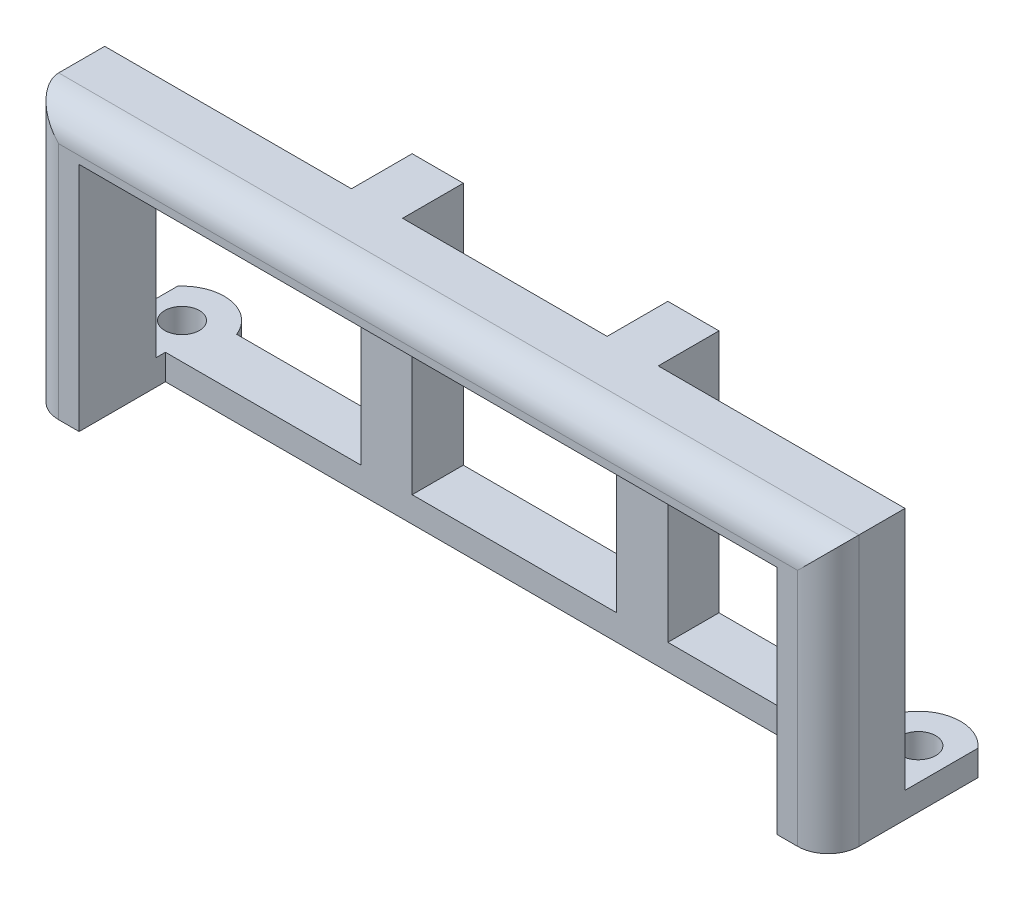
ISO-10303-21;
HEADER;
FILE_DESCRIPTION(('STEP AP214'),'2;1');
FILE_NAME('part.step','',(''),(''),'','','');
FILE_SCHEMA(('AUTOMOTIVE_DESIGN { 1 0 10303 214 1 1 1 1 }'));
ENDSEC;
DATA;
#1=APPLICATION_CONTEXT('core data for automotive mechanical design processes');
#2=APPLICATION_PROTOCOL_DEFINITION('international standard','automotive_design',2000,#1);
#3=PRODUCT_CONTEXT('',#1,'mechanical');
#4=PRODUCT('Part','Part','',(#3));
#5=PRODUCT_RELATED_PRODUCT_CATEGORY('part','',(#4));
#6=PRODUCT_DEFINITION_FORMATION('','',#4);
#7=PRODUCT_DEFINITION_CONTEXT('part definition',#1,'design');
#8=PRODUCT_DEFINITION('design','',#6,#7);
#9=PRODUCT_DEFINITION_SHAPE('','',#8);
#10=(LENGTH_UNIT() NAMED_UNIT(*) SI_UNIT(.MILLI.,.METRE.));
#11=(NAMED_UNIT(*) PLANE_ANGLE_UNIT() SI_UNIT($,.RADIAN.));
#12=(NAMED_UNIT(*) SI_UNIT($,.STERADIAN.) SOLID_ANGLE_UNIT());
#13=UNCERTAINTY_MEASURE_WITH_UNIT(LENGTH_MEASURE(1.E-05),#10,'distance_accuracy_value','');
#14=(GEOMETRIC_REPRESENTATION_CONTEXT(3) GLOBAL_UNCERTAINTY_ASSIGNED_CONTEXT((#13)) GLOBAL_UNIT_ASSIGNED_CONTEXT((#10,
#11,#12)) REPRESENTATION_CONTEXT('',''));
#15=CARTESIAN_POINT('',(0.,0.,0.));
#16=DIRECTION('',(0.,0.,1.));
#17=DIRECTION('',(1.,0.,0.));
#18=AXIS2_PLACEMENT_3D('',#15,#16,#17);
#19=CARTESIAN_POINT('',(0.,4.7625,-4.76249999999999));
#20=DIRECTION('',(0.,0.,-1.));
#21=DIRECTION('',(-1.,0.,0.));
#22=AXIS2_PLACEMENT_3D('',#19,#20,#21);
#23=PLANE('',#22);
#24=DIRECTION('',(0.,-1.,0.));
#25=VECTOR('',#24,1.);
#26=CARTESIAN_POINT('',(49.68875,4.7625,-4.7625));
#27=LINE('',#26,#25);
#28=CARTESIAN_POINT('',(49.68875,4.7625,-4.7625));
#29=VERTEX_POINT('',#28);
#30=CARTESIAN_POINT('',(49.68875,-25.55875,-4.7625));
#31=VERTEX_POINT('',#30);
#32=EDGE_CURVE('E518',#29,#31,#27,.T.);
#33=ORIENTED_EDGE('',*,*,#32,.T.);
#34=DIRECTION('',(-1.,0.,0.));
#35=VECTOR('',#34,1.);
#36=CARTESIAN_POINT('',(0.,-25.55875,-4.76249999999999));
#37=LINE('',#36,#35);
#38=CARTESIAN_POINT('',(43.33875,-25.55875,-4.7625));
#39=VERTEX_POINT('',#38);
#40=EDGE_CURVE('E330',#31,#39,#37,.T.);
#41=ORIENTED_EDGE('',*,*,#40,.T.);
#42=DIRECTION('',(0.,1.,0.));
#43=VECTOR('',#42,1.);
#44=CARTESIAN_POINT('',(43.33875,-28.73375,-4.7625));
#45=LINE('',#44,#43);
#46=CARTESIAN_POINT('',(43.33875,0.,-4.7625));
#47=VERTEX_POINT('',#46);
#48=EDGE_CURVE('E284',#39,#47,#45,.T.);
#49=ORIENTED_EDGE('',*,*,#48,.T.);
#50=DIRECTION('',(1.,0.,0.));
#51=VECTOR('',#50,1.);
#52=CARTESIAN_POINT('',(0.,0.,-4.76249999999999));
#53=LINE('',#52,#51);
#54=CARTESIAN_POINT('',(19.05,0.,-4.76249999999999));
#55=VERTEX_POINT('',#54);
#56=EDGE_CURVE('E510',#55,#47,#53,.T.);
#57=ORIENTED_EDGE('',*,*,#56,.F.);
#58=DIRECTION('',(0.,-1.,0.));
#59=VECTOR('',#58,1.);
#60=CARTESIAN_POINT('',(19.05,4.7625,-4.76249999999999));
#61=LINE('',#60,#59);
#62=CARTESIAN_POINT('',(19.05,4.7625,-4.76249999999999));
#63=VERTEX_POINT('',#62);
#64=EDGE_CURVE('E433',#63,#55,#61,.T.);
#65=ORIENTED_EDGE('',*,*,#64,.F.);
#66=DIRECTION('',(1.,0.,0.));
#67=VECTOR('',#66,1.);
#68=CARTESIAN_POINT('',(0.,4.7625,-4.76249999999999));
#69=LINE('',#68,#67);
#70=EDGE_CURVE('E504',#63,#29,#69,.T.);
#71=ORIENTED_EDGE('',*,*,#70,.T.);
#72=EDGE_LOOP('',(#33,#41,#49,#57,#65,#71));
#73=FACE_BOUND('',#72,.T.);
#74=ADVANCED_FACE('F90',(#73),#23,.T.);
#75=CARTESIAN_POINT('',(19.05,4.7625,-4.76249999999999));
#76=DIRECTION('',(1.,0.,0.));
#77=DIRECTION('',(0.,0.,1.));
#78=AXIS2_PLACEMENT_3D('',#75,#76,#77);
#79=PLANE('',#78);
#80=DIRECTION('',(0.,1.,0.));
#81=VECTOR('',#80,1.);
#82=CARTESIAN_POINT('',(19.05,-28.73375,-5.95312499999999));
#83=LINE('',#82,#81);
#84=CARTESIAN_POINT('',(19.05,-25.55875,-5.95312499999999));
#85=VERTEX_POINT('',#84);
#86=CARTESIAN_POINT('',(19.05,0.,-5.95312499999999));
#87=VERTEX_POINT('',#86);
#88=EDGE_CURVE('E398',#85,#87,#83,.T.);
#89=ORIENTED_EDGE('',*,*,#88,.F.);
#90=DIRECTION('',(0.,0.,-1.));
#91=VECTOR('',#90,1.);
#92=CARTESIAN_POINT('',(19.05,-25.55875,-4.76249999999999));
#93=LINE('',#92,#91);
#94=CARTESIAN_POINT('',(19.05,-25.55875,-12.303125));
#95=VERTEX_POINT('',#94);
#96=EDGE_CURVE('E307',#85,#95,#93,.T.);
#97=ORIENTED_EDGE('',*,*,#96,.T.);
#98=DIRECTION('',(0.,-1.,0.));
#99=VECTOR('',#98,1.);
#100=CARTESIAN_POINT('',(19.05,4.7625,-12.303125));
#101=LINE('',#100,#99);
#102=CARTESIAN_POINT('',(19.05,4.7625,-12.303125));
#103=VERTEX_POINT('',#102);
#104=EDGE_CURVE('E429',#103,#95,#101,.T.);
#105=ORIENTED_EDGE('',*,*,#104,.F.);
#106=DIRECTION('',(0.,0.,-1.));
#107=VECTOR('',#106,1.);
#108=CARTESIAN_POINT('',(19.05,4.7625,-4.76249999999999));
#109=LINE('',#108,#107);
#110=EDGE_CURVE('E418',#63,#103,#109,.T.);
#111=ORIENTED_EDGE('',*,*,#110,.F.);
#112=ORIENTED_EDGE('',*,*,#64,.T.);
#113=DIRECTION('',(0.,0.,-1.));
#114=VECTOR('',#113,1.);
#115=CARTESIAN_POINT('',(19.05,0.,-4.76249999999999));
#116=LINE('',#115,#114);
#117=EDGE_CURVE('E414',#55,#87,#116,.T.);
#118=ORIENTED_EDGE('',*,*,#117,.T.);
#119=EDGE_LOOP('',(#89,#97,#105,#111,#112,#118));
#120=FACE_BOUND('',#119,.T.);
#121=ADVANCED_FACE('F658',(#120),#79,.T.);
#122=CARTESIAN_POINT('',(12.7,4.7625,-4.76249999999999));
#123=DIRECTION('',(1.,0.,0.));
#124=DIRECTION('',(0.,0.,1.));
#125=AXIS2_PLACEMENT_3D('',#122,#123,#124);
#126=PLANE('',#125);
#127=DIRECTION('',(0.,0.,-1.));
#128=VECTOR('',#127,1.);
#129=CARTESIAN_POINT('',(12.7,-25.55875,0.));
#130=LINE('',#129,#128);
#131=CARTESIAN_POINT('',(12.7,-25.55875,-5.95312499999999));
#132=VERTEX_POINT('',#131);
#133=CARTESIAN_POINT('',(12.7,-25.55875,-12.303125));
#134=VERTEX_POINT('',#133);
#135=EDGE_CURVE('E336',#132,#134,#130,.T.);
#136=ORIENTED_EDGE('',*,*,#135,.F.);
#137=DIRECTION('',(0.,1.,0.));
#138=VECTOR('',#137,1.);
#139=CARTESIAN_POINT('',(12.7,-28.73375,-5.95312499999999));
#140=LINE('',#139,#138);
#141=CARTESIAN_POINT('',(12.7,0.,-5.95312499999999));
#142=VERTEX_POINT('',#141);
#143=EDGE_CURVE('E399',#132,#142,#140,.T.);
#144=ORIENTED_EDGE('',*,*,#143,.T.);
#145=DIRECTION('',(0.,0.,-1.));
#146=VECTOR('',#145,1.);
#147=CARTESIAN_POINT('',(12.7,0.,-4.76249999999999));
#148=LINE('',#147,#146);
#149=CARTESIAN_POINT('',(12.7,0.,-4.7625));
#150=VERTEX_POINT('',#149);
#151=EDGE_CURVE('E408',#150,#142,#148,.T.);
#152=ORIENTED_EDGE('',*,*,#151,.F.);
#153=DIRECTION('',(0.,-1.,0.));
#154=VECTOR('',#153,1.);
#155=CARTESIAN_POINT('',(12.7,4.7625,-4.76249999999999));
#156=LINE('',#155,#154);
#157=CARTESIAN_POINT('',(12.7,4.7625,-4.76249999999999));
#158=VERTEX_POINT('',#157);
#159=EDGE_CURVE('E436',#158,#150,#156,.T.);
#160=ORIENTED_EDGE('',*,*,#159,.F.);
#161=DIRECTION('',(0.,0.,-1.));
#162=VECTOR('',#161,1.);
#163=CARTESIAN_POINT('',(12.7,4.7625,-4.76249999999999));
#164=LINE('',#163,#162);
#165=CARTESIAN_POINT('',(12.7,4.7625,-12.303125));
#166=VERTEX_POINT('',#165);
#167=EDGE_CURVE('E413',#158,#166,#164,.T.);
#168=ORIENTED_EDGE('',*,*,#167,.T.);
#169=DIRECTION('',(0.,-1.,0.));
#170=VECTOR('',#169,1.);
#171=CARTESIAN_POINT('',(12.7,4.7625,-12.303125));
#172=LINE('',#171,#170);
#173=EDGE_CURVE('E422',#166,#134,#172,.T.);
#174=ORIENTED_EDGE('',*,*,#173,.T.);
#175=EDGE_LOOP('',(#136,#144,#152,#160,#168,#174));
#176=FACE_BOUND('',#175,.T.);
#177=ADVANCED_FACE('F665',(#176),#126,.F.);
#178=DIRECTION('',(0.,1.,0.));
#179=VECTOR('',#178,1.);
#180=CARTESIAN_POINT('',(-43.33875,-28.73375,-4.76249999999999));
#181=LINE('',#180,#179);
#182=CARTESIAN_POINT('',(-43.33875,-25.55875,-4.76249999999999));
#183=VERTEX_POINT('',#182);
#184=CARTESIAN_POINT('',(-43.33875,0.,-4.76249999999999));
#185=VERTEX_POINT('',#184);
#186=EDGE_CURVE('E488',#183,#185,#181,.T.);
#187=ORIENTED_EDGE('',*,*,#186,.F.);
#188=DIRECTION('',(-1.,0.,0.));
#189=VECTOR('',#188,1.);
#190=CARTESIAN_POINT('',(0.,-25.55875,-4.76249999999999));
#191=LINE('',#190,#189);
#192=CARTESIAN_POINT('',(-49.68875,-25.55875,-4.76249999999999));
#193=VERTEX_POINT('',#192);
#194=EDGE_CURVE('E384',#183,#193,#191,.T.);
#195=ORIENTED_EDGE('',*,*,#194,.T.);
#196=DIRECTION('',(0.,-1.,0.));
#197=VECTOR('',#196,1.);
#198=CARTESIAN_POINT('',(-49.68875,4.7625,-4.76249999999999));
#199=LINE('',#198,#197);
#200=CARTESIAN_POINT('',(-49.68875,4.7625,-4.76249999999999));
#201=VERTEX_POINT('',#200);
#202=EDGE_CURVE('E517',#201,#193,#199,.T.);
#203=ORIENTED_EDGE('',*,*,#202,.F.);
#204=CARTESIAN_POINT('',(-19.05,4.7625,-4.76249999999999));
#205=VERTEX_POINT('',#204);
#206=EDGE_CURVE('E498',#201,#205,#69,.T.);
#207=ORIENTED_EDGE('',*,*,#206,.T.);
#208=DIRECTION('',(0.,-1.,0.));
#209=VECTOR('',#208,1.);
#210=CARTESIAN_POINT('',(-19.05,4.7625,-4.76249999999999));
#211=LINE('',#210,#209);
#212=CARTESIAN_POINT('',(-19.05,0.,-4.76249999999999));
#213=VERTEX_POINT('',#212);
#214=EDGE_CURVE('E502',#205,#213,#211,.T.);
#215=ORIENTED_EDGE('',*,*,#214,.T.);
#216=EDGE_CURVE('E505',#185,#213,#53,.T.);
#217=ORIENTED_EDGE('',*,*,#216,.F.);
#218=EDGE_LOOP('',(#187,#195,#203,#207,#215,#217));
#219=FACE_BOUND('',#218,.T.);
#220=ADVANCED_FACE('F633',(#219),#23,.T.);
#221=CARTESIAN_POINT('',(-19.05,4.7625,-4.76249999999999));
#222=DIRECTION('',(-1.,0.,0.));
#223=DIRECTION('',(0.,0.,1.));
#224=AXIS2_PLACEMENT_3D('',#221,#222,#223);
#225=PLANE('',#224);
#226=DIRECTION('',(0.,-1.,0.));
#227=VECTOR('',#226,1.);
#228=CARTESIAN_POINT('',(-19.05,4.7625,-12.303125));
#229=LINE('',#228,#227);
#230=CARTESIAN_POINT('',(-19.05,4.7625,-12.303125));
#231=VERTEX_POINT('',#230);
#232=CARTESIAN_POINT('',(-19.05,-25.55875,-12.303125));
#233=VERTEX_POINT('',#232);
#234=EDGE_CURVE('E526',#231,#233,#229,.T.);
#235=ORIENTED_EDGE('',*,*,#234,.T.);
#236=DIRECTION('',(0.,0.,1.));
#237=VECTOR('',#236,1.);
#238=CARTESIAN_POINT('',(-19.05,-25.55875,-4.76249999999999));
#239=LINE('',#238,#237);
#240=CARTESIAN_POINT('',(-19.05,-25.55875,-5.95312499999999));
#241=VERTEX_POINT('',#240);
#242=EDGE_CURVE('E361',#233,#241,#239,.T.);
#243=ORIENTED_EDGE('',*,*,#242,.T.);
#244=DIRECTION('',(0.,1.,0.));
#245=VECTOR('',#244,1.);
#246=CARTESIAN_POINT('',(-19.05,-28.73375,-5.95312499999999));
#247=LINE('',#246,#245);
#248=CARTESIAN_POINT('',(-19.05,0.,-5.95312499999999));
#249=VERTEX_POINT('',#248);
#250=EDGE_CURVE('E440',#241,#249,#247,.T.);
#251=ORIENTED_EDGE('',*,*,#250,.T.);
#252=DIRECTION('',(0.,0.,-1.));
#253=VECTOR('',#252,1.);
#254=CARTESIAN_POINT('',(-19.05,0.,-4.76249999999999));
#255=LINE('',#254,#253);
#256=EDGE_CURVE('E535',#213,#249,#255,.T.);
#257=ORIENTED_EDGE('',*,*,#256,.F.);
#258=ORIENTED_EDGE('',*,*,#214,.F.);
#259=DIRECTION('',(0.,0.,-1.));
#260=VECTOR('',#259,1.);
#261=CARTESIAN_POINT('',(-19.05,4.7625,-4.76249999999999));
#262=LINE('',#261,#260);
#263=EDGE_CURVE('E538',#205,#231,#262,.T.);
#264=ORIENTED_EDGE('',*,*,#263,.T.);
#265=EDGE_LOOP('',(#235,#243,#251,#257,#258,#264));
#266=FACE_BOUND('',#265,.T.);
#267=ADVANCED_FACE('F684',(#266),#225,.T.);
#268=CARTESIAN_POINT('',(-12.7,4.7625,-4.76249999999999));
#269=DIRECTION('',(-1.,0.,0.));
#270=DIRECTION('',(0.,0.,1.));
#271=AXIS2_PLACEMENT_3D('',#268,#269,#270);
#272=PLANE('',#271);
#273=DIRECTION('',(0.,0.,-1.));
#274=VECTOR('',#273,1.);
#275=CARTESIAN_POINT('',(-12.7,-25.55875,0.));
#276=LINE('',#275,#274);
#277=CARTESIAN_POINT('',(-12.7,-25.55875,-5.95312499999999));
#278=VERTEX_POINT('',#277);
#279=CARTESIAN_POINT('',(-12.7,-25.55875,-12.303125));
#280=VERTEX_POINT('',#279);
#281=EDGE_CURVE('E391',#278,#280,#276,.T.);
#282=ORIENTED_EDGE('',*,*,#281,.T.);
#283=DIRECTION('',(0.,-1.,0.));
#284=VECTOR('',#283,1.);
#285=CARTESIAN_POINT('',(-12.7,4.7625,-12.303125));
#286=LINE('',#285,#284);
#287=CARTESIAN_POINT('',(-12.7,4.7625,-12.303125));
#288=VERTEX_POINT('',#287);
#289=EDGE_CURVE('E542',#288,#280,#286,.T.);
#290=ORIENTED_EDGE('',*,*,#289,.F.);
#291=DIRECTION('',(0.,0.,-1.));
#292=VECTOR('',#291,1.);
#293=CARTESIAN_POINT('',(-12.7,4.7625,-4.76249999999999));
#294=LINE('',#293,#292);
#295=CARTESIAN_POINT('',(-12.7,4.7625,-4.76249999999999));
#296=VERTEX_POINT('',#295);
#297=EDGE_CURVE('E534',#296,#288,#294,.T.);
#298=ORIENTED_EDGE('',*,*,#297,.F.);
#299=DIRECTION('',(0.,-1.,0.));
#300=VECTOR('',#299,1.);
#301=CARTESIAN_POINT('',(-12.7,4.7625,-4.76249999999999));
#302=LINE('',#301,#300);
#303=CARTESIAN_POINT('',(-12.7,0.,-4.76249999999999));
#304=VERTEX_POINT('',#303);
#305=EDGE_CURVE('E554',#296,#304,#302,.T.);
#306=ORIENTED_EDGE('',*,*,#305,.T.);
#307=DIRECTION('',(0.,0.,-1.));
#308=VECTOR('',#307,1.);
#309=CARTESIAN_POINT('',(-12.7,0.,-4.76249999999999));
#310=LINE('',#309,#308);
#311=CARTESIAN_POINT('',(-12.7,0.,-5.95312499999999));
#312=VERTEX_POINT('',#311);
#313=EDGE_CURVE('E495',#304,#312,#310,.T.);
#314=ORIENTED_EDGE('',*,*,#313,.T.);
#315=DIRECTION('',(0.,1.,0.));
#316=VECTOR('',#315,1.);
#317=CARTESIAN_POINT('',(-12.7,-28.73375,-5.95312499999999));
#318=LINE('',#317,#316);
#319=EDGE_CURVE('E444',#278,#312,#318,.T.);
#320=ORIENTED_EDGE('',*,*,#319,.F.);
#321=EDGE_LOOP('',(#282,#290,#298,#306,#314,#320));
#322=FACE_BOUND('',#321,.T.);
#323=ADVANCED_FACE('F682',(#322),#272,.F.);
#324=EDGE_CURVE('E503',#296,#158,#69,.T.);
#325=ORIENTED_EDGE('',*,*,#324,.T.);
#326=ORIENTED_EDGE('',*,*,#159,.T.);
#327=EDGE_CURVE('E509',#304,#150,#53,.T.);
#328=ORIENTED_EDGE('',*,*,#327,.F.);
#329=ORIENTED_EDGE('',*,*,#305,.F.);
#330=EDGE_LOOP('',(#325,#326,#328,#329));
#331=FACE_BOUND('',#330,.T.);
#332=ADVANCED_FACE('F669',(#331),#23,.T.);
#333=CARTESIAN_POINT('',(0.,0.,0.));
#334=DIRECTION('',(0.,1.,0.));
#335=DIRECTION('',(0.,0.,1.));
#336=AXIS2_PLACEMENT_3D('',#333,#334,#335);
#337=PLANE('',#336);
#338=ORIENTED_EDGE('',*,*,#313,.F.);
#339=ORIENTED_EDGE('',*,*,#327,.T.);
#340=ORIENTED_EDGE('',*,*,#151,.T.);
#341=DIRECTION('',(-1.,0.,0.));
#342=VECTOR('',#341,1.);
#343=CARTESIAN_POINT('',(19.05,0.,-5.95312499999999));
#344=LINE('',#343,#342);
#345=EDGE_CURVE('E402',#87,#142,#344,.T.);
#346=ORIENTED_EDGE('',*,*,#345,.F.);
#347=ORIENTED_EDGE('',*,*,#117,.F.);
#348=ORIENTED_EDGE('',*,*,#56,.T.);
#349=DIRECTION('',(0.,0.,1.));
#350=VECTOR('',#349,1.);
#351=CARTESIAN_POINT('',(43.33875,0.,0.));
#352=LINE('',#351,#350);
#353=CARTESIAN_POINT('',(43.33875,0.,4.7625));
#354=VERTEX_POINT('',#353);
#355=EDGE_CURVE('E464',#47,#354,#352,.T.);
#356=ORIENTED_EDGE('',*,*,#355,.T.);
#357=DIRECTION('',(1.,0.,0.));
#358=VECTOR('',#357,1.);
#359=CARTESIAN_POINT('',(0.,0.,4.7625));
#360=LINE('',#359,#358);
#361=CARTESIAN_POINT('',(-43.33875,0.,4.7625));
#362=VERTEX_POINT('',#361);
#363=EDGE_CURVE('E508',#362,#354,#360,.T.);
#364=ORIENTED_EDGE('',*,*,#363,.F.);
#365=DIRECTION('',(0.,0.,1.));
#366=VECTOR('',#365,1.);
#367=CARTESIAN_POINT('',(-43.33875,0.,0.));
#368=LINE('',#367,#366);
#369=EDGE_CURVE('E468',#185,#362,#368,.T.);
#370=ORIENTED_EDGE('',*,*,#369,.F.);
#371=ORIENTED_EDGE('',*,*,#216,.T.);
#372=ORIENTED_EDGE('',*,*,#256,.T.);
#373=DIRECTION('',(1.,0.,0.));
#374=VECTOR('',#373,1.);
#375=CARTESIAN_POINT('',(-19.05,0.,-5.95312499999999));
#376=LINE('',#375,#374);
#377=EDGE_CURVE('E450',#249,#312,#376,.T.);
#378=ORIENTED_EDGE('',*,*,#377,.T.);
#379=EDGE_LOOP('',(#338,#339,#340,#346,#347,#348,#356,#364,#370,#371,#372,#378));
#380=FACE_BOUND('',#379,.T.);
#381=ADVANCED_FACE('F610',(#380),#337,.F.);
#382=CARTESIAN_POINT('',(0.,4.7625,4.7625));
#383=DIRECTION('',(0.,0.,-1.));
#384=DIRECTION('',(-1.,0.,0.));
#385=AXIS2_PLACEMENT_3D('',#382,#383,#384);
#386=PLANE('',#385);
#387=DIRECTION('',(1.,0.,0.));
#388=VECTOR('',#387,1.);
#389=CARTESIAN_POINT('',(0.,-28.73375,4.7625));
#390=LINE('',#389,#388);
#391=CARTESIAN_POINT('',(43.33875,-28.73375,4.7625));
#392=VERTEX_POINT('',#391);
#393=CARTESIAN_POINT('',(45.87875,-28.73375,4.7625));
#394=VERTEX_POINT('',#393);
#395=EDGE_CURVE('E472',#392,#394,#390,.T.);
#396=ORIENTED_EDGE('',*,*,#395,.T.);
#397=DIRECTION('',(0.,-1.,0.));
#398=VECTOR('',#397,1.);
#399=CARTESIAN_POINT('',(45.87875,4.7625,4.7625));
#400=LINE('',#399,#398);
#401=CARTESIAN_POINT('',(45.87875,0.952500000000001,4.7625));
#402=VERTEX_POINT('',#401);
#403=EDGE_CURVE('E577',#394,#402,#400,.F.);
#404=ORIENTED_EDGE('',*,*,#403,.T.);
#405=DIRECTION('',(1.,0.,0.));
#406=VECTOR('',#405,1.);
#407=CARTESIAN_POINT('',(-49.68875,0.952500000000001,4.7625));
#408=LINE('',#407,#406);
#409=CARTESIAN_POINT('',(-45.87875,0.952500000000001,4.7625));
#410=VERTEX_POINT('',#409);
#411=EDGE_CURVE('E115',#402,#410,#408,.F.);
#412=ORIENTED_EDGE('',*,*,#411,.T.);
#413=DIRECTION('',(0.,-1.,0.));
#414=VECTOR('',#413,1.);
#415=CARTESIAN_POINT('',(-45.87875,4.7625,4.7625));
#416=LINE('',#415,#414);
#417=CARTESIAN_POINT('',(-45.87875,-28.73375,4.7625));
#418=VERTEX_POINT('',#417);
#419=EDGE_CURVE('E574',#410,#418,#416,.T.);
#420=ORIENTED_EDGE('',*,*,#419,.T.);
#421=DIRECTION('',(1.,0.,0.));
#422=VECTOR('',#421,1.);
#423=CARTESIAN_POINT('',(0.,-28.73375,4.7625));
#424=LINE('',#423,#422);
#425=CARTESIAN_POINT('',(-43.33875,-28.73375,4.7625));
#426=VERTEX_POINT('',#425);
#427=EDGE_CURVE('E485',#418,#426,#424,.T.);
#428=ORIENTED_EDGE('',*,*,#427,.T.);
#429=DIRECTION('',(0.,1.,0.));
#430=VECTOR('',#429,1.);
#431=CARTESIAN_POINT('',(-43.33875,-28.73375,4.7625));
#432=LINE('',#431,#430);
#433=EDGE_CURVE('E492',#426,#362,#432,.T.);
#434=ORIENTED_EDGE('',*,*,#433,.T.);
#435=ORIENTED_EDGE('',*,*,#363,.T.);
#436=DIRECTION('',(0.,1.,0.));
#437=VECTOR('',#436,1.);
#438=CARTESIAN_POINT('',(43.33875,-28.73375,4.7625));
#439=LINE('',#438,#437);
#440=EDGE_CURVE('E454',#392,#354,#439,.T.);
#441=ORIENTED_EDGE('',*,*,#440,.F.);
#442=EDGE_LOOP('',(#396,#404,#412,#420,#428,#434,#435,#441));
#443=FACE_BOUND('',#442,.T.);
#444=ADVANCED_FACE('F597',(#443),#386,.F.);
#445=CARTESIAN_POINT('',(0.,4.7625,0.));
#446=DIRECTION('',(0.,1.,0.));
#447=DIRECTION('',(0.,0.,1.));
#448=AXIS2_PLACEMENT_3D('',#445,#446,#447);
#449=PLANE('',#448);
#450=DIRECTION('',(0.,0.,1.));
#451=VECTOR('',#450,1.);
#452=CARTESIAN_POINT('',(-49.68875,4.7625,-4.76249999999999));
#453=LINE('',#452,#451);
#454=CARTESIAN_POINT('',(-49.68875,4.7625,0.9525));
#455=VERTEX_POINT('',#454);
#456=EDGE_CURVE('E514',#201,#455,#453,.T.);
#457=ORIENTED_EDGE('',*,*,#456,.T.);
#458=DIRECTION('',(1.,0.,0.));
#459=VECTOR('',#458,1.);
#460=CARTESIAN_POINT('',(49.68875,4.7625,0.9525));
#461=LINE('',#460,#459);
#462=CARTESIAN_POINT('',(49.68875,4.7625,0.952499999999998));
#463=VERTEX_POINT('',#462);
#464=EDGE_CURVE('E12',#455,#463,#461,.T.);
#465=ORIENTED_EDGE('',*,*,#464,.T.);
#466=DIRECTION('',(0.,0.,1.));
#467=VECTOR('',#466,1.);
#468=CARTESIAN_POINT('',(49.68875,4.7625,-4.7625));
#469=LINE('',#468,#467);
#470=EDGE_CURVE('E522',#29,#463,#469,.T.);
#471=ORIENTED_EDGE('',*,*,#470,.F.);
#472=ORIENTED_EDGE('',*,*,#70,.F.);
#473=ORIENTED_EDGE('',*,*,#110,.T.);
#474=DIRECTION('',(-1.,0.,0.));
#475=VECTOR('',#474,1.);
#476=CARTESIAN_POINT('',(19.05,4.7625,-12.303125));
#477=LINE('',#476,#475);
#478=EDGE_CURVE('E409',#103,#166,#477,.T.);
#479=ORIENTED_EDGE('',*,*,#478,.T.);
#480=ORIENTED_EDGE('',*,*,#167,.F.);
#481=ORIENTED_EDGE('',*,*,#324,.F.);
#482=ORIENTED_EDGE('',*,*,#297,.T.);
#483=DIRECTION('',(1.,0.,0.));
#484=VECTOR('',#483,1.);
#485=CARTESIAN_POINT('',(-19.05,4.7625,-12.303125));
#486=LINE('',#485,#484);
#487=EDGE_CURVE('E530',#231,#288,#486,.T.);
#488=ORIENTED_EDGE('',*,*,#487,.F.);
#489=ORIENTED_EDGE('',*,*,#263,.F.);
#490=ORIENTED_EDGE('',*,*,#206,.F.);
#491=EDGE_LOOP('',(#457,#465,#471,#472,#473,#479,#480,#481,#482,#488,#489,#490));
#492=FACE_BOUND('',#491,.T.);
#493=ADVANCED_FACE('F626',(#492),#449,.T.);
#494=CARTESIAN_POINT('',(-19.05,4.7625,-12.303125));
#495=DIRECTION('',(0.,0.,-1.));
#496=DIRECTION('',(-1.,0.,0.));
#497=AXIS2_PLACEMENT_3D('',#494,#495,#496);
#498=PLANE('',#497);
#499=DIRECTION('',(0.,-1.,0.));
#500=VECTOR('',#499,1.);
#501=CARTESIAN_POINT('',(40.8422331442368,-25.55875,-12.303125));
#502=LINE('',#501,#500);
#503=CARTESIAN_POINT('',(40.8422331442368,-25.55875,-12.303125));
#504=VERTEX_POINT('',#503);
#505=CARTESIAN_POINT('',(40.8422331442368,-28.73375,-12.303125));
#506=VERTEX_POINT('',#505);
#507=EDGE_CURVE('E301',#504,#506,#502,.T.);
#508=ORIENTED_EDGE('',*,*,#507,.T.);
#509=DIRECTION('',(1.,0.,0.));
#510=VECTOR('',#509,1.);
#511=CARTESIAN_POINT('',(-19.05,-28.73375,-12.303125));
#512=LINE('',#511,#510);
#513=CARTESIAN_POINT('',(-40.8422331442368,-28.73375,-12.303125));
#514=VERTEX_POINT('',#513);
#515=EDGE_CURVE('E447',#514,#506,#512,.T.);
#516=ORIENTED_EDGE('',*,*,#515,.F.);
#517=DIRECTION('',(0.,-1.,0.));
#518=VECTOR('',#517,1.);
#519=CARTESIAN_POINT('',(-40.8422331442368,-25.55875,-12.303125));
#520=LINE('',#519,#518);
#521=CARTESIAN_POINT('',(-40.8422331442368,-25.55875,-12.303125));
#522=VERTEX_POINT('',#521);
#523=EDGE_CURVE('E346',#522,#514,#520,.T.);
#524=ORIENTED_EDGE('',*,*,#523,.F.);
#525=DIRECTION('',(1.,0.,0.));
#526=VECTOR('',#525,1.);
#527=CARTESIAN_POINT('',(0.,-25.55875,-12.303125));
#528=LINE('',#527,#526);
#529=EDGE_CURVE('E368',#522,#233,#528,.T.);
#530=ORIENTED_EDGE('',*,*,#529,.T.);
#531=ORIENTED_EDGE('',*,*,#234,.F.);
#532=ORIENTED_EDGE('',*,*,#487,.T.);
#533=ORIENTED_EDGE('',*,*,#289,.T.);
#534=DIRECTION('',(1.,0.,0.));
#535=VECTOR('',#534,1.);
#536=CARTESIAN_POINT('',(0.,-25.55875,-12.303125));
#537=LINE('',#536,#535);
#538=EDGE_CURVE('E395',#280,#134,#537,.T.);
#539=ORIENTED_EDGE('',*,*,#538,.T.);
#540=ORIENTED_EDGE('',*,*,#173,.F.);
#541=ORIENTED_EDGE('',*,*,#478,.F.);
#542=ORIENTED_EDGE('',*,*,#104,.T.);
#543=DIRECTION('',(-1.,0.,0.));
#544=VECTOR('',#543,1.);
#545=CARTESIAN_POINT('',(0.,-25.55875,-12.303125));
#546=LINE('',#545,#544);
#547=EDGE_CURVE('E309',#504,#95,#546,.T.);
#548=ORIENTED_EDGE('',*,*,#547,.F.);
#549=EDGE_LOOP('',(#508,#516,#524,#530,#531,#532,#533,#539,#540,#541,#542,#548));
#550=FACE_BOUND('',#549,.T.);
#551=ADVANCED_FACE('F646',(#550),#498,.T.);
#552=CARTESIAN_POINT('',(-49.68875,4.7625,-4.76249999999999));
#553=DIRECTION('',(1.,0.,0.));
#554=DIRECTION('',(0.,0.,-1.));
#555=AXIS2_PLACEMENT_3D('',#552,#553,#554);
#556=PLANE('',#555);
#557=DIRECTION('',(0.,0.,-1.));
#558=VECTOR('',#557,1.);
#559=CARTESIAN_POINT('',(-49.68875,-28.73375,0.));
#560=LINE('',#559,#558);
#561=CARTESIAN_POINT('',(-49.68875,-28.73375,0.9525));
#562=VERTEX_POINT('',#561);
#563=CARTESIAN_POINT('',(-49.68875,-28.73375,-13.814359467463));
#564=VERTEX_POINT('',#563);
#565=EDGE_CURVE('E482',#562,#564,#560,.T.);
#566=ORIENTED_EDGE('',*,*,#565,.F.);
#567=DIRECTION('',(0.,-1.,0.));
#568=VECTOR('',#567,1.);
#569=CARTESIAN_POINT('',(-49.68875,4.7625,0.9525));
#570=LINE('',#569,#568);
#571=EDGE_CURVE('E100',#562,#455,#570,.F.);
#572=ORIENTED_EDGE('',*,*,#571,.T.);
#573=ORIENTED_EDGE('',*,*,#456,.F.);
#574=ORIENTED_EDGE('',*,*,#202,.T.);
#575=DIRECTION('',(0.,0.,-1.));
#576=VECTOR('',#575,1.);
#577=CARTESIAN_POINT('',(-49.68875,-25.55875,0.));
#578=LINE('',#577,#576);
#579=CARTESIAN_POINT('',(-49.68875,-25.55875,-13.814359467463));
#580=VERTEX_POINT('',#579);
#581=EDGE_CURVE('E376',#193,#580,#578,.T.);
#582=ORIENTED_EDGE('',*,*,#581,.T.);
#583=DIRECTION('',(0.,-1.,0.));
#584=VECTOR('',#583,1.);
#585=CARTESIAN_POINT('',(-49.68875,-25.55875,-13.814359467463));
#586=LINE('',#585,#584);
#587=EDGE_CURVE('E341',#580,#564,#586,.T.);
#588=ORIENTED_EDGE('',*,*,#587,.T.);
#589=EDGE_LOOP('',(#566,#572,#573,#574,#582,#588));
#590=FACE_BOUND('',#589,.T.);
#591=ADVANCED_FACE('F629',(#590),#556,.F.);
#592=CARTESIAN_POINT('',(49.68875,4.7625,-4.7625));
#593=DIRECTION('',(1.,0.,0.));
#594=DIRECTION('',(0.,0.,-1.));
#595=AXIS2_PLACEMENT_3D('',#592,#593,#594);
#596=PLANE('',#595);
#597=ORIENTED_EDGE('',*,*,#470,.T.);
#598=DIRECTION('',(0.,-1.,0.));
#599=VECTOR('',#598,1.);
#600=CARTESIAN_POINT('',(49.68875,-28.73375,0.9525));
#601=LINE('',#600,#599);
#602=CARTESIAN_POINT('',(49.68875,-28.73375,0.9525));
#603=VERTEX_POINT('',#602);
#604=EDGE_CURVE('E562',#463,#603,#601,.T.);
#605=ORIENTED_EDGE('',*,*,#604,.T.);
#606=DIRECTION('',(0.,0.,-1.));
#607=VECTOR('',#606,1.);
#608=CARTESIAN_POINT('',(49.68875,-28.73375,0.));
#609=LINE('',#608,#607);
#610=CARTESIAN_POINT('',(49.68875,-28.73375,-13.814359467463));
#611=VERTEX_POINT('',#610);
#612=EDGE_CURVE('E461',#603,#611,#609,.T.);
#613=ORIENTED_EDGE('',*,*,#612,.T.);
#614=DIRECTION('',(0.,-1.,0.));
#615=VECTOR('',#614,1.);
#616=CARTESIAN_POINT('',(49.68875,-25.55875,-13.814359467463));
#617=LINE('',#616,#615);
#618=CARTESIAN_POINT('',(49.68875,-25.55875,-13.814359467463));
#619=VERTEX_POINT('',#618);
#620=EDGE_CURVE('E326',#619,#611,#617,.T.);
#621=ORIENTED_EDGE('',*,*,#620,.F.);
#622=DIRECTION('',(0.,0.,-1.));
#623=VECTOR('',#622,1.);
#624=CARTESIAN_POINT('',(49.68875,-25.55875,0.));
#625=LINE('',#624,#623);
#626=EDGE_CURVE('E290',#31,#619,#625,.T.);
#627=ORIENTED_EDGE('',*,*,#626,.F.);
#628=ORIENTED_EDGE('',*,*,#32,.F.);
#629=EDGE_LOOP('',(#597,#605,#613,#621,#627,#628));
#630=FACE_BOUND('',#629,.T.);
#631=ADVANCED_FACE('F619',(#630),#596,.T.);
#632=CARTESIAN_POINT('',(-43.33875,-28.73375,0.));
#633=DIRECTION('',(-1.,0.,0.));
#634=DIRECTION('',(0.,0.,1.));
#635=AXIS2_PLACEMENT_3D('',#632,#633,#634);
#636=PLANE('',#635);
#637=DIRECTION('',(0.,0.,1.));
#638=VECTOR('',#637,1.);
#639=CARTESIAN_POINT('',(-43.33875,-28.73375,0.));
#640=LINE('',#639,#638);
#641=CARTESIAN_POINT('',(-43.33875,-28.73375,-5.95312499999999));
#642=VERTEX_POINT('',#641);
#643=EDGE_CURVE('E478',#642,#426,#640,.T.);
#644=ORIENTED_EDGE('',*,*,#643,.F.);
#645=DIRECTION('',(0.,-1.,0.));
#646=VECTOR('',#645,1.);
#647=CARTESIAN_POINT('',(-43.33875,-25.55875,-5.95312499999999));
#648=LINE('',#647,#646);
#649=CARTESIAN_POINT('',(-43.33875,-25.55875,-5.95312499999999));
#650=VERTEX_POINT('',#649);
#651=EDGE_CURVE('E340',#650,#642,#648,.T.);
#652=ORIENTED_EDGE('',*,*,#651,.F.);
#653=DIRECTION('',(0.,0.,-1.));
#654=VECTOR('',#653,1.);
#655=CARTESIAN_POINT('',(-43.33875,-25.55875,0.));
#656=LINE('',#655,#654);
#657=EDGE_CURVE('E345',#183,#650,#656,.T.);
#658=ORIENTED_EDGE('',*,*,#657,.F.);
#659=ORIENTED_EDGE('',*,*,#186,.T.);
#660=ORIENTED_EDGE('',*,*,#369,.T.);
#661=ORIENTED_EDGE('',*,*,#433,.F.);
#662=EDGE_LOOP('',(#644,#652,#658,#659,#660,#661));
#663=FACE_BOUND('',#662,.T.);
#664=ADVANCED_FACE('F605',(#663),#636,.F.);
#665=CARTESIAN_POINT('',(0.,-28.73375,0.));
#666=DIRECTION('',(0.,1.,0.));
#667=DIRECTION('',(0.,0.,1.));
#668=AXIS2_PLACEMENT_3D('',#665,#666,#667);
#669=PLANE('',#668);
#670=ORIENTED_EDGE('',*,*,#612,.F.);
#671=CARTESIAN_POINT('',(45.87875,-28.73375,0.9525));
#672=DIRECTION('',(0.,1.,0.));
#673=DIRECTION('',(0.,0.,1.));
#674=AXIS2_PLACEMENT_3D('',#671,#672,#673);
#675=CIRCLE('',#674,3.81);
#676=EDGE_CURVE('E569',#603,#394,#675,.F.);
#677=ORIENTED_EDGE('',*,*,#676,.T.);
#678=ORIENTED_EDGE('',*,*,#395,.F.);
#679=DIRECTION('',(0.,0.,1.));
#680=VECTOR('',#679,1.);
#681=CARTESIAN_POINT('',(43.33875,-28.73375,0.));
#682=LINE('',#681,#680);
#683=CARTESIAN_POINT('',(43.33875,-28.73375,-5.95312499999999));
#684=VERTEX_POINT('',#683);
#685=EDGE_CURVE('E469',#684,#392,#682,.T.);
#686=ORIENTED_EDGE('',*,*,#685,.F.);
#687=DIRECTION('',(1.,0.,0.));
#688=VECTOR('',#687,1.);
#689=CARTESIAN_POINT('',(-19.05,-28.73375,-5.95312499999999));
#690=LINE('',#689,#688);
#691=EDGE_CURVE('E299',#642,#684,#690,.T.);
#692=ORIENTED_EDGE('',*,*,#691,.F.);
#693=ORIENTED_EDGE('',*,*,#643,.T.);
#694=ORIENTED_EDGE('',*,*,#427,.F.);
#695=CARTESIAN_POINT('',(-45.87875,-28.73375,0.9525));
#696=DIRECTION('',(0.,1.,0.));
#697=DIRECTION('',(0.,0.,1.));
#698=AXIS2_PLACEMENT_3D('',#695,#696,#697);
#699=CIRCLE('',#698,3.81);
#700=EDGE_CURVE('E566',#418,#562,#699,.F.);
#701=ORIENTED_EDGE('',*,*,#700,.T.);
#702=ORIENTED_EDGE('',*,*,#565,.T.);
#703=CARTESIAN_POINT('',(-45.72,-28.73375,-10.398125));
#704=DIRECTION('',(0.,-1.,0.));
#705=DIRECTION('',(0.,0.,-1.));
#706=AXIS2_PLACEMENT_3D('',#703,#704,#705);
#707=CIRCLE('',#706,5.23656705286795);
#708=EDGE_CURVE('E352',#564,#514,#707,.T.);
#709=ORIENTED_EDGE('',*,*,#708,.T.);
#710=ORIENTED_EDGE('',*,*,#515,.T.);
#711=CARTESIAN_POINT('',(45.72,-28.73375,-10.398125));
#712=DIRECTION('',(0.,1.,0.));
#713=DIRECTION('',(0.,0.,-1.));
#714=AXIS2_PLACEMENT_3D('',#711,#712,#713);
#715=CIRCLE('',#714,5.23656705286795);
#716=EDGE_CURVE('E321',#611,#506,#715,.T.);
#717=ORIENTED_EDGE('',*,*,#716,.F.);
#718=EDGE_LOOP('',(#670,#677,#678,#686,#692,#693,#694,#701,#702,#709,#710,#717));
#719=FACE_BOUND('',#718,.T.);
#720=CARTESIAN_POINT('',(45.72,-28.73375,-10.398125));
#721=DIRECTION('',(0.,1.,0.));
#722=DIRECTION('',(0.,0.,-1.));
#723=AXIS2_PLACEMENT_3D('',#720,#721,#722);
#724=CIRCLE('',#723,2.15265);
#725=CARTESIAN_POINT('',(45.72,-28.73375,-12.550775));
#726=VERTEX_POINT('',#725);
#727=EDGE_CURVE('E317',#726,#726,#724,.T.);
#728=ORIENTED_EDGE('',*,*,#727,.T.);
#729=EDGE_LOOP('',(#728));
#730=FACE_BOUND('',#729,.T.);
#731=CARTESIAN_POINT('',(-45.72,-28.73375,-10.398125));
#732=DIRECTION('',(0.,-1.,0.));
#733=DIRECTION('',(0.,0.,-1.));
#734=AXIS2_PLACEMENT_3D('',#731,#732,#733);
#735=CIRCLE('',#734,2.15265);
#736=CARTESIAN_POINT('',(-45.72,-28.73375,-12.550775));
#737=VERTEX_POINT('',#736);
#738=EDGE_CURVE('E356',#737,#737,#735,.T.);
#739=ORIENTED_EDGE('',*,*,#738,.F.);
#740=EDGE_LOOP('',(#739));
#741=FACE_BOUND('',#740,.T.);
#742=ADVANCED_FACE('F600',(#719,#730,#741),#669,.F.);
#743=CARTESIAN_POINT('',(43.33875,-28.73375,0.));
#744=DIRECTION('',(-1.,0.,0.));
#745=DIRECTION('',(0.,0.,1.));
#746=AXIS2_PLACEMENT_3D('',#743,#744,#745);
#747=PLANE('',#746);
#748=ORIENTED_EDGE('',*,*,#440,.T.);
#749=ORIENTED_EDGE('',*,*,#355,.F.);
#750=ORIENTED_EDGE('',*,*,#48,.F.);
#751=DIRECTION('',(0.,0.,-1.));
#752=VECTOR('',#751,1.);
#753=CARTESIAN_POINT('',(43.33875,-25.55875,0.));
#754=LINE('',#753,#752);
#755=CARTESIAN_POINT('',(43.33875,-25.55875,-5.95312499999999));
#756=VERTEX_POINT('',#755);
#757=EDGE_CURVE('E278',#39,#756,#754,.T.);
#758=ORIENTED_EDGE('',*,*,#757,.T.);
#759=DIRECTION('',(0.,-1.,0.));
#760=VECTOR('',#759,1.);
#761=CARTESIAN_POINT('',(43.33875,-25.55875,-5.95312499999999));
#762=LINE('',#761,#760);
#763=EDGE_CURVE('E282',#756,#684,#762,.T.);
#764=ORIENTED_EDGE('',*,*,#763,.T.);
#765=ORIENTED_EDGE('',*,*,#685,.T.);
#766=EDGE_LOOP('',(#748,#749,#750,#758,#764,#765));
#767=FACE_BOUND('',#766,.T.);
#768=ADVANCED_FACE('F280',(#767),#747,.T.);
#769=CARTESIAN_POINT('',(-19.05,-28.73375,-5.95312499999999));
#770=DIRECTION('',(0.,0.,1.));
#771=DIRECTION('',(1.,0.,0.));
#772=AXIS2_PLACEMENT_3D('',#769,#770,#771);
#773=PLANE('',#772);
#774=ORIENTED_EDGE('',*,*,#691,.T.);
#775=ORIENTED_EDGE('',*,*,#763,.F.);
#776=DIRECTION('',(-1.,0.,0.));
#777=VECTOR('',#776,1.);
#778=CARTESIAN_POINT('',(0.,-25.55875,-5.95312499999999));
#779=LINE('',#778,#777);
#780=EDGE_CURVE('E289',#756,#85,#779,.T.);
#781=ORIENTED_EDGE('',*,*,#780,.T.);
#782=ORIENTED_EDGE('',*,*,#88,.T.);
#783=ORIENTED_EDGE('',*,*,#345,.T.);
#784=ORIENTED_EDGE('',*,*,#143,.F.);
#785=DIRECTION('',(1.,0.,0.));
#786=VECTOR('',#785,1.);
#787=CARTESIAN_POINT('',(0.,-25.55875,-5.95312499999999));
#788=LINE('',#787,#786);
#789=EDGE_CURVE('E388',#278,#132,#788,.T.);
#790=ORIENTED_EDGE('',*,*,#789,.F.);
#791=ORIENTED_EDGE('',*,*,#319,.T.);
#792=ORIENTED_EDGE('',*,*,#377,.F.);
#793=ORIENTED_EDGE('',*,*,#250,.F.);
#794=DIRECTION('',(1.,0.,0.));
#795=VECTOR('',#794,1.);
#796=CARTESIAN_POINT('',(0.,-25.55875,-5.95312499999999));
#797=LINE('',#796,#795);
#798=EDGE_CURVE('E364',#650,#241,#797,.T.);
#799=ORIENTED_EDGE('',*,*,#798,.F.);
#800=ORIENTED_EDGE('',*,*,#651,.T.);
#801=EDGE_LOOP('',(#774,#775,#781,#782,#783,#784,#790,#791,#792,#793,#799,#800));
#802=FACE_BOUND('',#801,.T.);
#803=ADVANCED_FACE('F295',(#802),#773,.T.);
#804=CARTESIAN_POINT('',(0.,-25.55875,0.));
#805=DIRECTION('',(0.,-1.,0.));
#806=DIRECTION('',(0.,0.,-1.));
#807=AXIS2_PLACEMENT_3D('',#804,#805,#806);
#808=PLANE('',#807);
#809=ORIENTED_EDGE('',*,*,#789,.T.);
#810=ORIENTED_EDGE('',*,*,#135,.T.);
#811=ORIENTED_EDGE('',*,*,#538,.F.);
#812=ORIENTED_EDGE('',*,*,#281,.F.);
#813=EDGE_LOOP('',(#809,#810,#811,#812));
#814=FACE_BOUND('',#813,.T.);
#815=ADVANCED_FACE('F677',(#814),#808,.F.);
#816=CARTESIAN_POINT('',(-45.72,-25.55875,-10.398125));
#817=DIRECTION('',(0.,-1.,0.));
#818=DIRECTION('',(0.,0.,-1.));
#819=AXIS2_PLACEMENT_3D('',#816,#817,#818);
#820=CYLINDRICAL_SURFACE('',#819,2.15265);
#821=CARTESIAN_POINT('',(-45.72,-25.55875,-10.398125));
#822=DIRECTION('',(0.,-1.,0.));
#823=DIRECTION('',(0.,0.,-1.));
#824=AXIS2_PLACEMENT_3D('',#821,#822,#823);
#825=CIRCLE('',#824,2.15265);
#826=CARTESIAN_POINT('',(-45.72,-25.55875,-12.550775));
#827=VERTEX_POINT('',#826);
#828=EDGE_CURVE('E357',#827,#827,#825,.T.);
#829=ORIENTED_EDGE('',*,*,#828,.F.);
#830=EDGE_LOOP('',(#829));
#831=FACE_BOUND('',#830,.T.);
#832=ORIENTED_EDGE('',*,*,#738,.T.);
#833=EDGE_LOOP('',(#832));
#834=FACE_BOUND('',#833,.T.);
#835=ADVANCED_FACE('F725',(#831,#834),#820,.F.);
#836=CARTESIAN_POINT('',(-45.72,-25.55875,-10.398125));
#837=DIRECTION('',(0.,-1.,0.));
#838=DIRECTION('',(0.,0.,-1.));
#839=AXIS2_PLACEMENT_3D('',#836,#837,#838);
#840=CYLINDRICAL_SURFACE('',#839,5.23656705286795);
#841=ORIENTED_EDGE('',*,*,#708,.F.);
#842=ORIENTED_EDGE('',*,*,#587,.F.);
#843=CARTESIAN_POINT('',(-45.72,-25.55875,-10.398125));
#844=DIRECTION('',(0.,-1.,0.));
#845=DIRECTION('',(0.,0.,-1.));
#846=AXIS2_PLACEMENT_3D('',#843,#844,#845);
#847=CIRCLE('',#846,5.23656705286795);
#848=EDGE_CURVE('E372',#580,#522,#847,.T.);
#849=ORIENTED_EDGE('',*,*,#848,.T.);
#850=ORIENTED_EDGE('',*,*,#523,.T.);
#851=EDGE_LOOP('',(#841,#842,#849,#850));
#852=FACE_BOUND('',#851,.T.);
#853=ADVANCED_FACE('F650',(#852),#840,.T.);
#854=CARTESIAN_POINT('',(0.,-25.55875,0.));
#855=DIRECTION('',(0.,-1.,0.));
#856=DIRECTION('',(0.,0.,-1.));
#857=AXIS2_PLACEMENT_3D('',#854,#855,#856);
#858=PLANE('',#857);
#859=ORIENTED_EDGE('',*,*,#194,.F.);
#860=ORIENTED_EDGE('',*,*,#657,.T.);
#861=ORIENTED_EDGE('',*,*,#798,.T.);
#862=ORIENTED_EDGE('',*,*,#242,.F.);
#863=ORIENTED_EDGE('',*,*,#529,.F.);
#864=ORIENTED_EDGE('',*,*,#848,.F.);
#865=ORIENTED_EDGE('',*,*,#581,.F.);
#866=EDGE_LOOP('',(#859,#860,#861,#862,#863,#864,#865));
#867=FACE_BOUND('',#866,.T.);
#868=ORIENTED_EDGE('',*,*,#828,.T.);
#869=EDGE_LOOP('',(#868));
#870=FACE_BOUND('',#869,.T.);
#871=ADVANCED_FACE('F636',(#867,#870),#858,.F.);
#872=CARTESIAN_POINT('',(45.72,-25.55875,-10.398125));
#873=DIRECTION('',(0.,-1.,0.));
#874=DIRECTION('',(0.,0.,-1.));
#875=AXIS2_PLACEMENT_3D('',#872,#873,#874);
#876=CYLINDRICAL_SURFACE('',#875,5.23656705286795);
#877=ORIENTED_EDGE('',*,*,#716,.T.);
#878=ORIENTED_EDGE('',*,*,#507,.F.);
#879=CARTESIAN_POINT('',(45.72,-25.55875,-10.398125));
#880=DIRECTION('',(0.,1.,0.));
#881=DIRECTION('',(0.,0.,-1.));
#882=AXIS2_PLACEMENT_3D('',#879,#880,#881);
#883=CIRCLE('',#882,5.23656705286795);
#884=EDGE_CURVE('E302',#619,#504,#883,.T.);
#885=ORIENTED_EDGE('',*,*,#884,.F.);
#886=ORIENTED_EDGE('',*,*,#620,.T.);
#887=EDGE_LOOP('',(#877,#878,#885,#886));
#888=FACE_BOUND('',#887,.T.);
#889=ADVANCED_FACE('F653',(#888),#876,.T.);
#890=CARTESIAN_POINT('',(45.72,-25.55875,-10.398125));
#891=DIRECTION('',(0.,-1.,0.));
#892=DIRECTION('',(0.,0.,-1.));
#893=AXIS2_PLACEMENT_3D('',#890,#891,#892);
#894=CYLINDRICAL_SURFACE('',#893,2.15265);
#895=CARTESIAN_POINT('',(45.72,-25.55875,-10.398125));
#896=DIRECTION('',(0.,1.,0.));
#897=DIRECTION('',(0.,0.,-1.));
#898=AXIS2_PLACEMENT_3D('',#895,#896,#897);
#899=CIRCLE('',#898,2.15265);
#900=CARTESIAN_POINT('',(45.72,-25.55875,-12.550775));
#901=VERTEX_POINT('',#900);
#902=EDGE_CURVE('E325',#901,#901,#899,.T.);
#903=ORIENTED_EDGE('',*,*,#902,.T.);
#904=EDGE_LOOP('',(#903));
#905=FACE_BOUND('',#904,.T.);
#906=ORIENTED_EDGE('',*,*,#727,.F.);
#907=EDGE_LOOP('',(#906));
#908=FACE_BOUND('',#907,.T.);
#909=ADVANCED_FACE('F733',(#905,#908),#894,.F.);
#910=CARTESIAN_POINT('',(0.,-25.55875,0.));
#911=DIRECTION('',(0.,-1.,0.));
#912=DIRECTION('',(0.,0.,-1.));
#913=AXIS2_PLACEMENT_3D('',#910,#911,#912);
#914=PLANE('',#913);
#915=ORIENTED_EDGE('',*,*,#40,.F.);
#916=ORIENTED_EDGE('',*,*,#626,.T.);
#917=ORIENTED_EDGE('',*,*,#884,.T.);
#918=ORIENTED_EDGE('',*,*,#547,.T.);
#919=ORIENTED_EDGE('',*,*,#96,.F.);
#920=ORIENTED_EDGE('',*,*,#780,.F.);
#921=ORIENTED_EDGE('',*,*,#757,.F.);
#922=EDGE_LOOP('',(#915,#916,#917,#918,#919,#920,#921));
#923=FACE_BOUND('',#922,.T.);
#924=ORIENTED_EDGE('',*,*,#902,.F.);
#925=EDGE_LOOP('',(#924));
#926=FACE_BOUND('',#925,.T.);
#927=ADVANCED_FACE('F304',(#923,#926),#914,.F.);
#928=CARTESIAN_POINT('',(-45.87875,4.7625,0.9525));
#929=DIRECTION('',(0.,-1.,0.));
#930=DIRECTION('',(0.,0.,-1.));
#931=AXIS2_PLACEMENT_3D('',#928,#929,#930);
#932=CYLINDRICAL_SURFACE('',#931,3.81);
#933=ORIENTED_EDGE('',*,*,#700,.F.);
#934=ORIENTED_EDGE('',*,*,#419,.F.);
#935=CARTESIAN_POINT('',(-45.87875,0.952500000000001,0.9525));
#936=DIRECTION('',(-0.707106781186547,-0.707106781186547,0.));
#937=DIRECTION('',(-0.707106781186547,0.707106781186547,0.));
#938=AXIS2_PLACEMENT_3D('',#935,#936,#937);
#939=ELLIPSE('',#938,5.38815367264149,3.81);
#940=EDGE_CURVE('E94',#455,#410,#939,.F.);
#941=ORIENTED_EDGE('',*,*,#940,.F.);
#942=ORIENTED_EDGE('',*,*,#571,.F.);
#943=EDGE_LOOP('',(#933,#934,#941,#942));
#944=FACE_BOUND('',#943,.T.);
#945=ADVANCED_FACE('F92',(#944),#932,.T.);
#946=CARTESIAN_POINT('',(0.,0.952500000000001,0.9525));
#947=DIRECTION('',(-1.,0.,0.));
#948=DIRECTION('',(0.,0.,1.));
#949=AXIS2_PLACEMENT_3D('',#946,#947,#948);
#950=CYLINDRICAL_SURFACE('',#949,3.81);
#951=ORIENTED_EDGE('',*,*,#940,.T.);
#952=ORIENTED_EDGE('',*,*,#411,.F.);
#953=CARTESIAN_POINT('',(45.87875,0.952500000000001,0.9525));
#954=DIRECTION('',(-0.707106781186547,0.707106781186547,0.));
#955=DIRECTION('',(-0.707106781186547,-0.707106781186547,0.));
#956=AXIS2_PLACEMENT_3D('',#953,#954,#955);
#957=ELLIPSE('',#956,5.38815367264149,3.81);
#958=EDGE_CURVE('E581',#463,#402,#957,.F.);
#959=ORIENTED_EDGE('',*,*,#958,.F.);
#960=ORIENTED_EDGE('',*,*,#464,.F.);
#961=EDGE_LOOP('',(#951,#952,#959,#960));
#962=FACE_BOUND('',#961,.T.);
#963=ADVANCED_FACE('F593',(#962),#950,.T.);
#964=CARTESIAN_POINT('',(45.87875,4.7625,0.9525));
#965=DIRECTION('',(0.,1.,0.));
#966=DIRECTION('',(0.,0.,1.));
#967=AXIS2_PLACEMENT_3D('',#964,#965,#966);
#968=CYLINDRICAL_SURFACE('',#967,3.81);
#969=ORIENTED_EDGE('',*,*,#958,.T.);
#970=ORIENTED_EDGE('',*,*,#403,.F.);
#971=ORIENTED_EDGE('',*,*,#676,.F.);
#972=ORIENTED_EDGE('',*,*,#604,.F.);
#973=EDGE_LOOP('',(#969,#970,#971,#972));
#974=FACE_BOUND('',#973,.T.);
#975=ADVANCED_FACE('F617',(#974),#968,.T.);
#976=CLOSED_SHELL('',(#74,#121,#177,#220,#267,#323,#332,#381,#444,#493,#551,#591,#631,#664,#742,
#768,#803,#815,#835,#853,#871,#889,#909,#927,#945,#963,#975));
#977=MANIFOLD_SOLID_BREP('B2',#976);
#978=ADVANCED_BREP_SHAPE_REPRESENTATION('',(#18,#977),#14);
#979=SHAPE_DEFINITION_REPRESENTATION(#9,#978);
ENDSEC;
END-ISO-10303-21;
